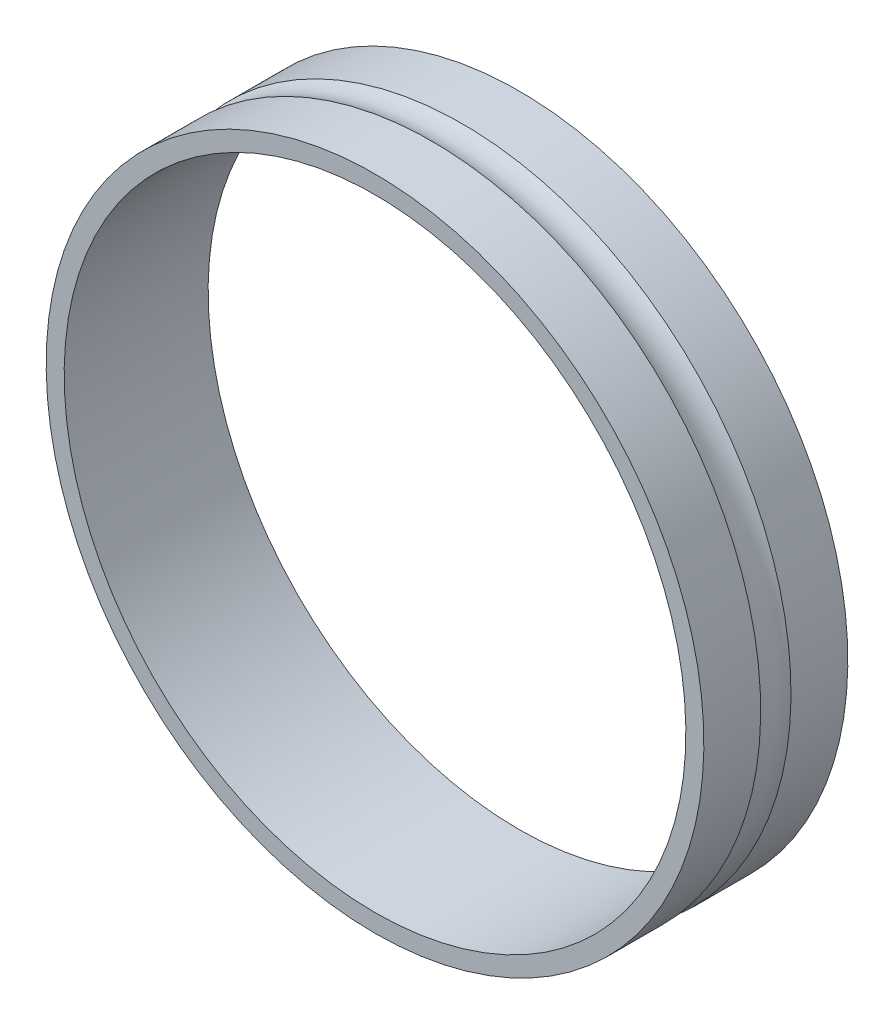
ISO-10303-21;
HEADER;
FILE_DESCRIPTION(('STEP AP214'),'2;1');
FILE_NAME('part.step','',(''),(''),'','','');
FILE_SCHEMA(('AUTOMOTIVE_DESIGN { 1 0 10303 214 1 1 1 1 }'));
ENDSEC;
DATA;
#1=APPLICATION_CONTEXT('core data for automotive mechanical design processes');
#2=APPLICATION_PROTOCOL_DEFINITION('international standard','automotive_design',2000,#1);
#3=PRODUCT_CONTEXT('',#1,'mechanical');
#4=PRODUCT('Part','Part','',(#3));
#5=PRODUCT_RELATED_PRODUCT_CATEGORY('part','',(#4));
#6=PRODUCT_DEFINITION_FORMATION('','',#4);
#7=PRODUCT_DEFINITION_CONTEXT('part definition',#1,'design');
#8=PRODUCT_DEFINITION('design','',#6,#7);
#9=PRODUCT_DEFINITION_SHAPE('','',#8);
#10=(LENGTH_UNIT() NAMED_UNIT(*) SI_UNIT(.MILLI.,.METRE.));
#11=(NAMED_UNIT(*) PLANE_ANGLE_UNIT() SI_UNIT($,.RADIAN.));
#12=(NAMED_UNIT(*) SI_UNIT($,.STERADIAN.) SOLID_ANGLE_UNIT());
#13=UNCERTAINTY_MEASURE_WITH_UNIT(LENGTH_MEASURE(1.E-05),#10,'distance_accuracy_value','');
#14=(GEOMETRIC_REPRESENTATION_CONTEXT(3) GLOBAL_UNCERTAINTY_ASSIGNED_CONTEXT((#13)) GLOBAL_UNIT_ASSIGNED_CONTEXT((#10,
#11,#12)) REPRESENTATION_CONTEXT('',''));
#15=CARTESIAN_POINT('',(0.,0.,0.));
#16=DIRECTION('',(0.,0.,1.));
#17=DIRECTION('',(1.,0.,0.));
#18=AXIS2_PLACEMENT_3D('',#15,#16,#17);
#19=CARTESIAN_POINT('',(10.365,0.,1.75));
#20=DIRECTION('',(0.,0.,1.));
#21=DIRECTION('',(0.,1.,0.));
#22=AXIS2_PLACEMENT_3D('',#19,#20,#21);
#23=PLANE('',#22);
#24=CARTESIAN_POINT('',(0.,0.,1.75));
#25=DIRECTION('',(0.,0.,1.));
#26=DIRECTION('',(0.,-1.,0.));
#27=AXIS2_PLACEMENT_3D('',#24,#25,#26);
#28=CIRCLE('',#27,10.965);
#29=CARTESIAN_POINT('',(0.,-10.965,1.75));
#30=VERTEX_POINT('',#29);
#31=EDGE_CURVE('E11',#30,#30,#28,.T.);
#32=ORIENTED_EDGE('',*,*,#31,.T.);
#33=EDGE_LOOP('',(#32));
#34=FACE_BOUND('',#33,.T.);
#35=CARTESIAN_POINT('',(0.,0.,1.75));
#36=DIRECTION('',(0.,0.,1.));
#37=DIRECTION('',(0.,-1.,0.));
#38=AXIS2_PLACEMENT_3D('',#35,#36,#37);
#39=CIRCLE('',#38,10.365);
#40=CARTESIAN_POINT('',(0.,-10.365,1.75));
#41=VERTEX_POINT('',#40);
#42=EDGE_CURVE('E52',#41,#41,#39,.T.);
#43=ORIENTED_EDGE('',*,*,#42,.F.);
#44=EDGE_LOOP('',(#43));
#45=FACE_BOUND('',#44,.T.);
#46=ADVANCED_FACE('F17',(#34,#45),#23,.T.);
#47=CARTESIAN_POINT('',(0.,0.,-0.65));
#48=DIRECTION('',(0.,0.,1.));
#49=DIRECTION('',(0.,1.,0.));
#50=AXIS2_PLACEMENT_3D('',#47,#48,#49);
#51=CYLINDRICAL_SURFACE('',#50,10.965);
#52=CARTESIAN_POINT('',(0.,0.,-0.144617966286883));
#53=DIRECTION('',(0.,0.,1.));
#54=DIRECTION('',(0.,-1.,0.));
#55=AXIS2_PLACEMENT_3D('',#52,#53,#54);
#56=CIRCLE('',#55,10.965);
#57=CARTESIAN_POINT('',(0.,-10.965,-0.144617966286883));
#58=VERTEX_POINT('',#57);
#59=EDGE_CURVE('E28',#58,#58,#56,.T.);
#60=ORIENTED_EDGE('',*,*,#59,.T.);
#61=EDGE_LOOP('',(#60));
#62=FACE_BOUND('',#61,.T.);
#63=ORIENTED_EDGE('',*,*,#31,.F.);
#64=EDGE_LOOP('',(#63));
#65=FACE_BOUND('',#64,.T.);
#66=ADVANCED_FACE('F84',(#62,#65),#51,.T.);
#67=CARTESIAN_POINT('',(0.,0.,-0.65));
#68=DIRECTION('',(0.,0.,1.));
#69=DIRECTION('',(0.,1.,0.));
#70=AXIS2_PLACEMENT_3D('',#67,#68,#69);
#71=TOROIDAL_SURFACE('',#70,11.998,1.15);
#72=CARTESIAN_POINT('',(0.,0.,-1.15538203371312));
#73=DIRECTION('',(0.,0.,1.));
#74=DIRECTION('',(0.,-1.,0.));
#75=AXIS2_PLACEMENT_3D('',#72,#73,#74);
#76=CIRCLE('',#75,10.965);
#77=CARTESIAN_POINT('',(0.,-10.965,-1.15538203371312));
#78=VERTEX_POINT('',#77);
#79=EDGE_CURVE('E57',#78,#78,#76,.T.);
#80=ORIENTED_EDGE('',*,*,#79,.T.);
#81=EDGE_LOOP('',(#80));
#82=FACE_BOUND('',#81,.T.);
#83=ORIENTED_EDGE('',*,*,#59,.F.);
#84=EDGE_LOOP('',(#83));
#85=FACE_BOUND('',#84,.T.);
#86=ADVANCED_FACE('F71',(#82,#85),#71,.F.);
#87=CARTESIAN_POINT('',(0.,0.,-0.65));
#88=DIRECTION('',(0.,0.,1.));
#89=DIRECTION('',(0.,1.,0.));
#90=AXIS2_PLACEMENT_3D('',#87,#88,#89);
#91=CYLINDRICAL_SURFACE('',#90,10.965);
#92=CARTESIAN_POINT('',(0.,0.,-3.05));
#93=DIRECTION('',(0.,0.,1.));
#94=DIRECTION('',(0.,-1.,0.));
#95=AXIS2_PLACEMENT_3D('',#92,#93,#94);
#96=CIRCLE('',#95,10.965);
#97=CARTESIAN_POINT('',(0.,-10.965,-3.05));
#98=VERTEX_POINT('',#97);
#99=EDGE_CURVE('E46',#98,#98,#96,.T.);
#100=ORIENTED_EDGE('',*,*,#99,.T.);
#101=EDGE_LOOP('',(#100));
#102=FACE_BOUND('',#101,.T.);
#103=ORIENTED_EDGE('',*,*,#79,.F.);
#104=EDGE_LOOP('',(#103));
#105=FACE_BOUND('',#104,.T.);
#106=ADVANCED_FACE('F74',(#102,#105),#91,.T.);
#107=CARTESIAN_POINT('',(10.965,0.,-3.05));
#108=DIRECTION('',(0.,0.,-1.));
#109=DIRECTION('',(0.,-1.,0.));
#110=AXIS2_PLACEMENT_3D('',#107,#108,#109);
#111=PLANE('',#110);
#112=CARTESIAN_POINT('',(0.,0.,-3.05));
#113=DIRECTION('',(0.,0.,1.));
#114=DIRECTION('',(0.,-1.,0.));
#115=AXIS2_PLACEMENT_3D('',#112,#113,#114);
#116=CIRCLE('',#115,10.365);
#117=CARTESIAN_POINT('',(0.,-10.365,-3.05));
#118=VERTEX_POINT('',#117);
#119=EDGE_CURVE('E21',#118,#118,#116,.T.);
#120=ORIENTED_EDGE('',*,*,#119,.T.);
#121=EDGE_LOOP('',(#120));
#122=FACE_BOUND('',#121,.T.);
#123=ORIENTED_EDGE('',*,*,#99,.F.);
#124=EDGE_LOOP('',(#123));
#125=FACE_BOUND('',#124,.T.);
#126=ADVANCED_FACE('F76',(#122,#125),#111,.T.);
#127=CARTESIAN_POINT('',(0.,0.,-0.65));
#128=DIRECTION('',(0.,0.,1.));
#129=DIRECTION('',(0.,1.,0.));
#130=AXIS2_PLACEMENT_3D('',#127,#128,#129);
#131=CYLINDRICAL_SURFACE('',#130,10.365);
#132=ORIENTED_EDGE('',*,*,#42,.T.);
#133=EDGE_LOOP('',(#132));
#134=FACE_BOUND('',#133,.T.);
#135=ORIENTED_EDGE('',*,*,#119,.F.);
#136=EDGE_LOOP('',(#135));
#137=FACE_BOUND('',#136,.T.);
#138=ADVANCED_FACE('F19',(#134,#137),#131,.F.);
#139=CLOSED_SHELL('',(#46,#66,#86,#106,#126,#138));
#140=MANIFOLD_SOLID_BREP('B1',#139);
#141=ADVANCED_BREP_SHAPE_REPRESENTATION('',(#18,#140),#14);
#142=SHAPE_DEFINITION_REPRESENTATION(#9,#141);
ENDSEC;
END-ISO-10303-21;
